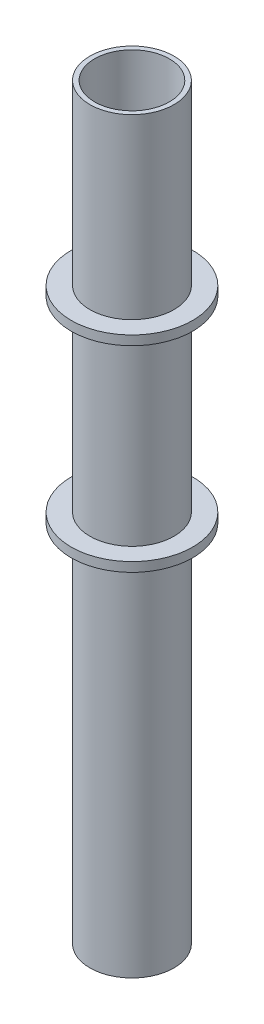
ISO-10303-21;
HEADER;
FILE_DESCRIPTION(('STEP AP214'),'2;1');
FILE_NAME('part.step','',(''),(''),'','','');
FILE_SCHEMA(('AUTOMOTIVE_DESIGN { 1 0 10303 214 1 1 1 1 }'));
ENDSEC;
DATA;
#1=APPLICATION_CONTEXT('core data for automotive mechanical design processes');
#2=APPLICATION_PROTOCOL_DEFINITION('international standard','automotive_design',2000,#1);
#3=PRODUCT_CONTEXT('',#1,'mechanical');
#4=PRODUCT('Part','Part','',(#3));
#5=PRODUCT_RELATED_PRODUCT_CATEGORY('part','',(#4));
#6=PRODUCT_DEFINITION_FORMATION('','',#4);
#7=PRODUCT_DEFINITION_CONTEXT('part definition',#1,'design');
#8=PRODUCT_DEFINITION('design','',#6,#7);
#9=PRODUCT_DEFINITION_SHAPE('','',#8);
#10=(LENGTH_UNIT() NAMED_UNIT(*) SI_UNIT(.MILLI.,.METRE.));
#11=(NAMED_UNIT(*) PLANE_ANGLE_UNIT() SI_UNIT($,.RADIAN.));
#12=(NAMED_UNIT(*) SI_UNIT($,.STERADIAN.) SOLID_ANGLE_UNIT());
#13=UNCERTAINTY_MEASURE_WITH_UNIT(LENGTH_MEASURE(1.E-05),#10,'distance_accuracy_value','');
#14=(GEOMETRIC_REPRESENTATION_CONTEXT(3) GLOBAL_UNCERTAINTY_ASSIGNED_CONTEXT((#13)) GLOBAL_UNIT_ASSIGNED_CONTEXT((#10,
#11,#12)) REPRESENTATION_CONTEXT('',''));
#15=CARTESIAN_POINT('',(0.,0.,0.));
#16=DIRECTION('',(0.,0.,1.));
#17=DIRECTION('',(1.,0.,0.));
#18=AXIS2_PLACEMENT_3D('',#15,#16,#17);
#19=CARTESIAN_POINT('',(2.22044604925031E-13,200.,-2.77555756156289E-13));
#20=DIRECTION('',(0.,-1.,0.));
#21=DIRECTION('',(0.,0.,-1.));
#22=AXIS2_PLACEMENT_3D('',#19,#20,#21);
#23=CYLINDRICAL_SURFACE('',#22,22.5);
#24=CARTESIAN_POINT('',(1.66533453693773E-13,-200.,-1.66533453693773E-13));
#25=DIRECTION('',(0.,1.,0.));
#26=DIRECTION('',(0.,0.,1.));
#27=AXIS2_PLACEMENT_3D('',#24,#25,#26);
#28=CIRCLE('',#27,22.5);
#29=CARTESIAN_POINT('',(1.64659952339719E-13,-200.,22.4999999999998));
#30=VERTEX_POINT('',#29);
#31=EDGE_CURVE('E54',#30,#30,#28,.T.);
#32=ORIENTED_EDGE('',*,*,#31,.T.);
#33=EDGE_LOOP('',(#32));
#34=FACE_BOUND('',#33,.T.);
#35=CARTESIAN_POINT('',(3.33066907387547E-13,-5.00000000000003,-2.22044604925031E-13));
#36=DIRECTION('',(0.,1.,0.));
#37=DIRECTION('',(0.,0.,1.));
#38=AXIS2_PLACEMENT_3D('',#35,#36,#37);
#39=CIRCLE('',#38,22.5);
#40=CARTESIAN_POINT('',(3.31193406033492E-13,-5.00000000000003,22.4999999999998));
#41=VERTEX_POINT('',#40);
#42=EDGE_CURVE('E10',#41,#41,#39,.T.);
#43=ORIENTED_EDGE('',*,*,#42,.F.);
#44=EDGE_LOOP('',(#43));
#45=FACE_BOUND('',#44,.T.);
#46=ADVANCED_FACE('F39',(#34,#45),#23,.T.);
#47=CARTESIAN_POINT('',(0.,0.,0.));
#48=DIRECTION('',(0.,1.,0.));
#49=DIRECTION('',(0.,0.,1.));
#50=AXIS2_PLACEMENT_3D('',#47,#48,#49);
#51=CIRCLE('',#50,22.5);
#52=CARTESIAN_POINT('',(0.,0.,22.5));
#53=VERTEX_POINT('',#52);
#54=EDGE_CURVE('E78',#53,#53,#51,.T.);
#55=ORIENTED_EDGE('',*,*,#54,.T.);
#56=EDGE_LOOP('',(#55));
#57=FACE_BOUND('',#56,.T.);
#58=CARTESIAN_POINT('',(0.,100.,-1.11022302462516E-13));
#59=DIRECTION('',(0.,1.,0.));
#60=DIRECTION('',(0.,0.,1.));
#61=AXIS2_PLACEMENT_3D('',#58,#59,#60);
#62=CIRCLE('',#61,22.5);
#63=CARTESIAN_POINT('',(0.,100.,22.4999999999999));
#64=VERTEX_POINT('',#63);
#65=EDGE_CURVE('E46',#64,#64,#62,.T.);
#66=ORIENTED_EDGE('',*,*,#65,.F.);
#67=EDGE_LOOP('',(#66));
#68=FACE_BOUND('',#67,.T.);
#69=ADVANCED_FACE('F84',(#57,#68),#23,.T.);
#70=CARTESIAN_POINT('',(2.22044604925031E-13,200.,-2.77555756156289E-13));
#71=DIRECTION('',(0.,1.,0.));
#72=DIRECTION('',(0.,0.,1.));
#73=AXIS2_PLACEMENT_3D('',#70,#71,#72);
#74=PLANE('',#73);
#75=CARTESIAN_POINT('',(2.22044604925031E-13,200.,-2.77555756156289E-13));
#76=DIRECTION('',(0.,1.,0.));
#77=DIRECTION('',(0.,0.,1.));
#78=AXIS2_PLACEMENT_3D('',#75,#76,#77);
#79=CIRCLE('',#78,22.5);
#80=CARTESIAN_POINT('',(2.20171103570976E-13,200.,22.4999999999997));
#81=VERTEX_POINT('',#80);
#82=EDGE_CURVE('E50',#81,#81,#79,.T.);
#83=ORIENTED_EDGE('',*,*,#82,.T.);
#84=EDGE_LOOP('',(#83));
#85=FACE_BOUND('',#84,.T.);
#86=CARTESIAN_POINT('',(2.22044604925031E-13,200.,-2.77555756156289E-13));
#87=DIRECTION('',(0.,1.,0.));
#88=DIRECTION('',(0.,0.,1.));
#89=AXIS2_PLACEMENT_3D('',#86,#87,#88);
#90=CIRCLE('',#89,20.);
#91=CARTESIAN_POINT('',(2.20379270388094E-13,200.,19.9999999999997));
#92=VERTEX_POINT('',#91);
#93=EDGE_CURVE('E58',#92,#92,#90,.T.);
#94=ORIENTED_EDGE('',*,*,#93,.F.);
#95=EDGE_LOOP('',(#94));
#96=FACE_BOUND('',#95,.T.);
#97=ADVANCED_FACE('F113',(#85,#96),#74,.T.);
#98=CARTESIAN_POINT('',(1.66533453693773E-13,-200.,-1.66533453693773E-13));
#99=DIRECTION('',(0.,1.,0.));
#100=DIRECTION('',(0.,0.,1.));
#101=AXIS2_PLACEMENT_3D('',#98,#99,#100);
#102=PLANE('',#101);
#103=ORIENTED_EDGE('',*,*,#31,.F.);
#104=EDGE_LOOP('',(#103));
#105=FACE_BOUND('',#104,.T.);
#106=CARTESIAN_POINT('',(1.66533453693773E-13,-200.,-1.66533453693773E-13));
#107=DIRECTION('',(0.,1.,0.));
#108=DIRECTION('',(0.,0.,1.));
#109=AXIS2_PLACEMENT_3D('',#106,#107,#108);
#110=CIRCLE('',#109,20.);
#111=CARTESIAN_POINT('',(1.64868119156836E-13,-200.,19.9999999999998));
#112=VERTEX_POINT('',#111);
#113=EDGE_CURVE('E60',#112,#112,#110,.T.);
#114=ORIENTED_EDGE('',*,*,#113,.T.);
#115=EDGE_LOOP('',(#114));
#116=FACE_BOUND('',#115,.T.);
#117=ADVANCED_FACE('F117',(#105,#116),#102,.F.);
#118=CARTESIAN_POINT('',(2.77555756156289E-13,105.,-1.11022302462516E-13));
#119=DIRECTION('',(0.,1.,0.));
#120=DIRECTION('',(0.,0.,1.));
#121=AXIS2_PLACEMENT_3D('',#118,#119,#120);
#122=CIRCLE('',#121,22.5);
#123=CARTESIAN_POINT('',(2.75682254802234E-13,105.,22.4999999999999));
#124=VERTEX_POINT('',#123);
#125=EDGE_CURVE('E69',#124,#124,#122,.T.);
#126=ORIENTED_EDGE('',*,*,#125,.T.);
#127=EDGE_LOOP('',(#126));
#128=FACE_BOUND('',#127,.T.);
#129=ORIENTED_EDGE('',*,*,#82,.F.);
#130=EDGE_LOOP('',(#129));
#131=FACE_BOUND('',#130,.T.);
#132=ADVANCED_FACE('F41',(#128,#131),#23,.T.);
#133=CARTESIAN_POINT('',(2.22044604925031E-13,200.,-2.77555756156289E-13));
#134=DIRECTION('',(0.,-1.,0.));
#135=DIRECTION('',(0.,0.,-1.));
#136=AXIS2_PLACEMENT_3D('',#133,#134,#135);
#137=CYLINDRICAL_SURFACE('',#136,20.);
#138=ORIENTED_EDGE('',*,*,#93,.T.);
#139=EDGE_LOOP('',(#138));
#140=FACE_BOUND('',#139,.T.);
#141=ORIENTED_EDGE('',*,*,#113,.F.);
#142=EDGE_LOOP('',(#141));
#143=FACE_BOUND('',#142,.T.);
#144=ADVANCED_FACE('F116',(#140,#143),#137,.F.);
#145=CARTESIAN_POINT('',(2.77555756156289E-13,105.,-1.11022302462516E-13));
#146=DIRECTION('',(0.,1.,0.));
#147=DIRECTION('',(0.,0.,1.));
#148=AXIS2_PLACEMENT_3D('',#145,#146,#147);
#149=PLANE('',#148);
#150=CARTESIAN_POINT('',(2.77555756156289E-13,105.,-1.11022302462516E-13));
#151=DIRECTION('',(0.,1.,0.));
#152=DIRECTION('',(0.,0.,1.));
#153=AXIS2_PLACEMENT_3D('',#150,#151,#152);
#154=CIRCLE('',#153,32.5);
#155=CARTESIAN_POINT('',(2.74849587533765E-13,105.,32.4999999999999));
#156=VERTEX_POINT('',#155);
#157=EDGE_CURVE('E63',#156,#156,#154,.T.);
#158=ORIENTED_EDGE('',*,*,#157,.T.);
#159=EDGE_LOOP('',(#158));
#160=FACE_BOUND('',#159,.T.);
#161=ORIENTED_EDGE('',*,*,#125,.F.);
#162=EDGE_LOOP('',(#161));
#163=FACE_BOUND('',#162,.T.);
#164=ADVANCED_FACE('F123',(#160,#163),#149,.T.);
#165=CARTESIAN_POINT('',(0.,100.,-1.11022302462516E-13));
#166=DIRECTION('',(0.,1.,0.));
#167=DIRECTION('',(0.,0.,1.));
#168=AXIS2_PLACEMENT_3D('',#165,#166,#167);
#169=PLANE('',#168);
#170=CARTESIAN_POINT('',(0.,100.,-1.11022302462516E-13));
#171=DIRECTION('',(0.,1.,0.));
#172=DIRECTION('',(0.,0.,1.));
#173=AXIS2_PLACEMENT_3D('',#170,#171,#172);
#174=CIRCLE('',#173,32.5);
#175=CARTESIAN_POINT('',(0.,100.,32.4999999999999));
#176=VERTEX_POINT('',#175);
#177=EDGE_CURVE('E66',#176,#176,#174,.T.);
#178=ORIENTED_EDGE('',*,*,#177,.F.);
#179=EDGE_LOOP('',(#178));
#180=FACE_BOUND('',#179,.T.);
#181=ORIENTED_EDGE('',*,*,#65,.T.);
#182=EDGE_LOOP('',(#181));
#183=FACE_BOUND('',#182,.T.);
#184=ADVANCED_FACE('F104',(#180,#183),#169,.F.);
#185=CARTESIAN_POINT('',(2.77555756156289E-13,105.,-1.11022302462516E-13));
#186=DIRECTION('',(0.,-1.,0.));
#187=DIRECTION('',(0.,0.,-1.));
#188=AXIS2_PLACEMENT_3D('',#185,#186,#187);
#189=CYLINDRICAL_SURFACE('',#188,32.5);
#190=ORIENTED_EDGE('',*,*,#157,.F.);
#191=EDGE_LOOP('',(#190));
#192=FACE_BOUND('',#191,.T.);
#193=ORIENTED_EDGE('',*,*,#177,.T.);
#194=EDGE_LOOP('',(#193));
#195=FACE_BOUND('',#194,.T.);
#196=ADVANCED_FACE('F96',(#192,#195),#189,.T.);
#197=CARTESIAN_POINT('',(3.33066907387547E-13,-5.00000000000003,-2.22044604925031E-13));
#198=DIRECTION('',(0.,1.,0.));
#199=DIRECTION('',(0.,0.,1.));
#200=AXIS2_PLACEMENT_3D('',#197,#198,#199);
#201=CYLINDRICAL_SURFACE('',#200,32.5);
#202=CARTESIAN_POINT('',(3.33066907387547E-13,-5.00000000000003,-2.22044604925031E-13));
#203=DIRECTION('',(0.,1.,0.));
#204=DIRECTION('',(0.,0.,1.));
#205=AXIS2_PLACEMENT_3D('',#202,#203,#204);
#206=CIRCLE('',#205,32.5);
#207=CARTESIAN_POINT('',(3.30360738765023E-13,-5.00000000000003,32.4999999999998));
#208=VERTEX_POINT('',#207);
#209=EDGE_CURVE('E74',#208,#208,#206,.T.);
#210=ORIENTED_EDGE('',*,*,#209,.T.);
#211=EDGE_LOOP('',(#210));
#212=FACE_BOUND('',#211,.T.);
#213=CARTESIAN_POINT('',(0.,0.,0.));
#214=DIRECTION('',(0.,1.,0.));
#215=DIRECTION('',(0.,0.,1.));
#216=AXIS2_PLACEMENT_3D('',#213,#214,#215);
#217=CIRCLE('',#216,32.5);
#218=CARTESIAN_POINT('',(0.,0.,32.5));
#219=VERTEX_POINT('',#218);
#220=EDGE_CURVE('E75',#219,#219,#217,.T.);
#221=ORIENTED_EDGE('',*,*,#220,.F.);
#222=EDGE_LOOP('',(#221));
#223=FACE_BOUND('',#222,.T.);
#224=ADVANCED_FACE('F94',(#212,#223),#201,.T.);
#225=CARTESIAN_POINT('',(3.33066907387547E-13,-5.00000000000003,-2.22044604925031E-13));
#226=DIRECTION('',(0.,1.,0.));
#227=DIRECTION('',(0.,0.,1.));
#228=AXIS2_PLACEMENT_3D('',#225,#226,#227);
#229=PLANE('',#228);
#230=ORIENTED_EDGE('',*,*,#42,.T.);
#231=EDGE_LOOP('',(#230));
#232=FACE_BOUND('',#231,.T.);
#233=ORIENTED_EDGE('',*,*,#209,.F.);
#234=EDGE_LOOP('',(#233));
#235=FACE_BOUND('',#234,.T.);
#236=ADVANCED_FACE('F90',(#232,#235),#229,.F.);
#237=CARTESIAN_POINT('',(0.,0.,0.));
#238=DIRECTION('',(0.,1.,0.));
#239=DIRECTION('',(0.,0.,1.));
#240=AXIS2_PLACEMENT_3D('',#237,#238,#239);
#241=PLANE('',#240);
#242=ORIENTED_EDGE('',*,*,#54,.F.);
#243=EDGE_LOOP('',(#242));
#244=FACE_BOUND('',#243,.T.);
#245=ORIENTED_EDGE('',*,*,#220,.T.);
#246=EDGE_LOOP('',(#245));
#247=FACE_BOUND('',#246,.T.);
#248=ADVANCED_FACE('F87',(#244,#247),#241,.T.);
#249=CLOSED_SHELL('',(#46,#69,#97,#117,#132,#144,#164,#184,#196,#224,#236,#248));
#250=MANIFOLD_SOLID_BREP('B2',#249);
#251=ADVANCED_BREP_SHAPE_REPRESENTATION('',(#18,#250),#14);
#252=SHAPE_DEFINITION_REPRESENTATION(#9,#251);
ENDSEC;
END-ISO-10303-21;
